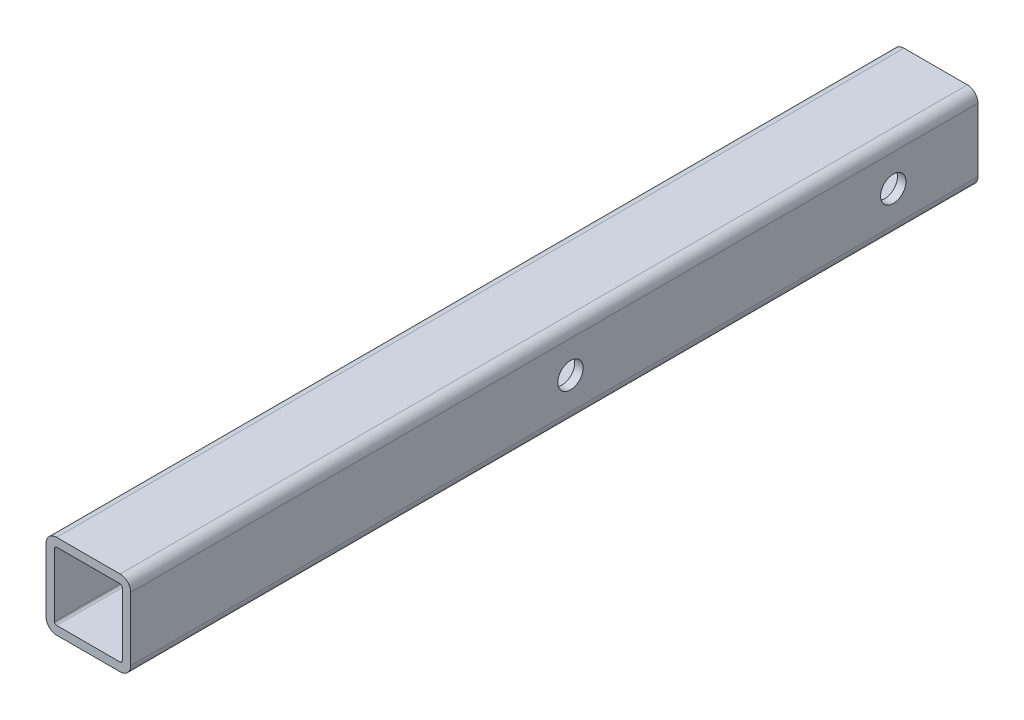
ISO-10303-21;
HEADER;
FILE_DESCRIPTION(('STEP AP214'),'2;1');
FILE_NAME('part.step','',(''),(''),'','','');
FILE_SCHEMA(('AUTOMOTIVE_DESIGN { 1 0 10303 214 1 1 1 1 }'));
ENDSEC;
DATA;
#1=APPLICATION_CONTEXT('core data for automotive mechanical design processes');
#2=APPLICATION_PROTOCOL_DEFINITION('international standard','automotive_design',2000,#1);
#3=PRODUCT_CONTEXT('',#1,'mechanical');
#4=PRODUCT('Part','Part','',(#3));
#5=PRODUCT_RELATED_PRODUCT_CATEGORY('part','',(#4));
#6=PRODUCT_DEFINITION_FORMATION('','',#4);
#7=PRODUCT_DEFINITION_CONTEXT('part definition',#1,'design');
#8=PRODUCT_DEFINITION('design','',#6,#7);
#9=PRODUCT_DEFINITION_SHAPE('','',#8);
#10=(LENGTH_UNIT() NAMED_UNIT(*) SI_UNIT(.MILLI.,.METRE.));
#11=(NAMED_UNIT(*) PLANE_ANGLE_UNIT() SI_UNIT($,.RADIAN.));
#12=(NAMED_UNIT(*) SI_UNIT($,.STERADIAN.) SOLID_ANGLE_UNIT());
#13=UNCERTAINTY_MEASURE_WITH_UNIT(LENGTH_MEASURE(1.E-05),#10,'distance_accuracy_value','');
#14=(GEOMETRIC_REPRESENTATION_CONTEXT(3) GLOBAL_UNCERTAINTY_ASSIGNED_CONTEXT((#13)) GLOBAL_UNIT_ASSIGNED_CONTEXT((#10,
#11,#12)) REPRESENTATION_CONTEXT('',''));
#15=CARTESIAN_POINT('',(0.,0.,0.));
#16=DIRECTION('',(0.,0.,1.));
#17=DIRECTION('',(1.,0.,0.));
#18=AXIS2_PLACEMENT_3D('',#15,#16,#17);
#19=CARTESIAN_POINT('',(-7.5,7.5,100.));
#20=DIRECTION('',(0.,0.,1.));
#21=DIRECTION('',(1.,0.,0.));
#22=AXIS2_PLACEMENT_3D('',#19,#20,#21);
#23=PLANE('',#22);
#24=CARTESIAN_POINT('',(-7.5,7.5,100.));
#25=DIRECTION('',(0.,0.,1.));
#26=DIRECTION('',(1.,0.,0.));
#27=AXIS2_PLACEMENT_3D('',#24,#25,#26);
#28=CIRCLE('',#27,2.5);
#29=CARTESIAN_POINT('',(-7.5,10.,100.));
#30=VERTEX_POINT('',#29);
#31=CARTESIAN_POINT('',(-10.,7.5,100.));
#32=VERTEX_POINT('',#31);
#33=EDGE_CURVE('E264',#30,#32,#28,.T.);
#34=ORIENTED_EDGE('',*,*,#33,.T.);
#35=DIRECTION('',(0.,-1.,0.));
#36=VECTOR('',#35,1.);
#37=CARTESIAN_POINT('',(-10.,-7.5,100.));
#38=LINE('',#37,#36);
#39=CARTESIAN_POINT('',(-10.,-7.5,100.));
#40=VERTEX_POINT('',#39);
#41=EDGE_CURVE('E267',#32,#40,#38,.T.);
#42=ORIENTED_EDGE('',*,*,#41,.T.);
#43=CARTESIAN_POINT('',(-7.5,-7.5,100.));
#44=DIRECTION('',(0.,0.,1.));
#45=DIRECTION('',(-1.,0.,0.));
#46=AXIS2_PLACEMENT_3D('',#43,#44,#45);
#47=CIRCLE('',#46,2.5);
#48=CARTESIAN_POINT('',(-7.5,-10.,100.));
#49=VERTEX_POINT('',#48);
#50=EDGE_CURVE('E270',#40,#49,#47,.T.);
#51=ORIENTED_EDGE('',*,*,#50,.T.);
#52=DIRECTION('',(1.,0.,0.));
#53=VECTOR('',#52,1.);
#54=CARTESIAN_POINT('',(7.5,-10.,100.));
#55=LINE('',#54,#53);
#56=CARTESIAN_POINT('',(7.5,-10.,100.));
#57=VERTEX_POINT('',#56);
#58=EDGE_CURVE('E272',#49,#57,#55,.T.);
#59=ORIENTED_EDGE('',*,*,#58,.T.);
#60=CARTESIAN_POINT('',(7.5,-7.5,100.));
#61=DIRECTION('',(0.,0.,1.));
#62=DIRECTION('',(1.,0.,0.));
#63=AXIS2_PLACEMENT_3D('',#60,#61,#62);
#64=CIRCLE('',#63,2.5);
#65=CARTESIAN_POINT('',(10.,-7.5,100.));
#66=VERTEX_POINT('',#65);
#67=EDGE_CURVE('E274',#57,#66,#64,.T.);
#68=ORIENTED_EDGE('',*,*,#67,.T.);
#69=DIRECTION('',(0.,1.,0.));
#70=VECTOR('',#69,1.);
#71=CARTESIAN_POINT('',(10.,-7.5,100.));
#72=LINE('',#71,#70);
#73=CARTESIAN_POINT('',(10.,7.5,100.));
#74=VERTEX_POINT('',#73);
#75=EDGE_CURVE('E276',#66,#74,#72,.T.);
#76=ORIENTED_EDGE('',*,*,#75,.T.);
#77=CARTESIAN_POINT('',(7.5,7.5,100.));
#78=DIRECTION('',(0.,0.,1.));
#79=DIRECTION('',(1.,0.,0.));
#80=AXIS2_PLACEMENT_3D('',#77,#78,#79);
#81=CIRCLE('',#80,2.5);
#82=CARTESIAN_POINT('',(7.5,10.,100.));
#83=VERTEX_POINT('',#82);
#84=EDGE_CURVE('E278',#74,#83,#81,.T.);
#85=ORIENTED_EDGE('',*,*,#84,.T.);
#86=DIRECTION('',(-1.,0.,0.));
#87=VECTOR('',#86,1.);
#88=CARTESIAN_POINT('',(7.5,10.,100.));
#89=LINE('',#88,#87);
#90=EDGE_CURVE('E280',#83,#30,#89,.T.);
#91=ORIENTED_EDGE('',*,*,#90,.T.);
#92=EDGE_LOOP('',(#34,#42,#51,#59,#68,#76,#85,#91));
#93=FACE_BOUND('',#92,.T.);
#94=DIRECTION('',(0.,-1.,0.));
#95=VECTOR('',#94,1.);
#96=CARTESIAN_POINT('',(-8.,-7.5,100.));
#97=LINE('',#96,#95);
#98=CARTESIAN_POINT('',(-8.,7.5,100.));
#99=VERTEX_POINT('',#98);
#100=CARTESIAN_POINT('',(-8.,-7.5,100.));
#101=VERTEX_POINT('',#100);
#102=EDGE_CURVE('E205',#99,#101,#97,.T.);
#103=ORIENTED_EDGE('',*,*,#102,.F.);
#104=CARTESIAN_POINT('',(-7.5,7.5,100.));
#105=DIRECTION('',(0.,0.,1.));
#106=DIRECTION('',(1.,0.,0.));
#107=AXIS2_PLACEMENT_3D('',#104,#105,#106);
#108=CIRCLE('',#107,0.499999999999999);
#109=CARTESIAN_POINT('',(-7.5,8.,100.));
#110=VERTEX_POINT('',#109);
#111=EDGE_CURVE('E197',#110,#99,#108,.T.);
#112=ORIENTED_EDGE('',*,*,#111,.F.);
#113=DIRECTION('',(-1.,0.,0.));
#114=VECTOR('',#113,1.);
#115=CARTESIAN_POINT('',(7.5,8.,100.));
#116=LINE('',#115,#114);
#117=CARTESIAN_POINT('',(7.5,8.,100.));
#118=VERTEX_POINT('',#117);
#119=EDGE_CURVE('E231',#118,#110,#116,.T.);
#120=ORIENTED_EDGE('',*,*,#119,.F.);
#121=CARTESIAN_POINT('',(7.5,7.5,100.));
#122=DIRECTION('',(0.,0.,1.));
#123=DIRECTION('',(1.,0.,0.));
#124=AXIS2_PLACEMENT_3D('',#121,#122,#123);
#125=CIRCLE('',#124,0.499999999999999);
#126=CARTESIAN_POINT('',(8.,7.5,100.));
#127=VERTEX_POINT('',#126);
#128=EDGE_CURVE('E229',#127,#118,#125,.T.);
#129=ORIENTED_EDGE('',*,*,#128,.F.);
#130=DIRECTION('',(0.,1.,0.));
#131=VECTOR('',#130,1.);
#132=CARTESIAN_POINT('',(8.,-7.5,100.));
#133=LINE('',#132,#131);
#134=CARTESIAN_POINT('',(8.,-7.5,100.));
#135=VERTEX_POINT('',#134);
#136=EDGE_CURVE('E227',#135,#127,#133,.T.);
#137=ORIENTED_EDGE('',*,*,#136,.F.);
#138=CARTESIAN_POINT('',(7.5,-7.5,100.));
#139=DIRECTION('',(0.,0.,1.));
#140=DIRECTION('',(1.,0.,0.));
#141=AXIS2_PLACEMENT_3D('',#138,#139,#140);
#142=CIRCLE('',#141,0.500000000000001);
#143=CARTESIAN_POINT('',(7.5,-8.,100.));
#144=VERTEX_POINT('',#143);
#145=EDGE_CURVE('E225',#144,#135,#142,.T.);
#146=ORIENTED_EDGE('',*,*,#145,.F.);
#147=DIRECTION('',(1.,0.,0.));
#148=VECTOR('',#147,1.);
#149=CARTESIAN_POINT('',(7.5,-8.,100.));
#150=LINE('',#149,#148);
#151=CARTESIAN_POINT('',(-7.5,-8.,100.));
#152=VERTEX_POINT('',#151);
#153=EDGE_CURVE('E220',#152,#144,#150,.T.);
#154=ORIENTED_EDGE('',*,*,#153,.F.);
#155=CARTESIAN_POINT('',(-7.5,-7.5,100.));
#156=DIRECTION('',(0.,0.,1.));
#157=DIRECTION('',(1.,0.,0.));
#158=AXIS2_PLACEMENT_3D('',#155,#156,#157);
#159=CIRCLE('',#158,0.500000000000002);
#160=EDGE_CURVE('E218',#101,#152,#159,.T.);
#161=ORIENTED_EDGE('',*,*,#160,.F.);
#162=EDGE_LOOP('',(#103,#112,#120,#129,#137,#146,#154,#161));
#163=FACE_BOUND('',#162,.T.);
#164=ADVANCED_FACE('F82',(#93,#163),#23,.T.);
#165=CARTESIAN_POINT('',(-7.5,7.5,-100.));
#166=DIRECTION('',(0.,0.,1.));
#167=DIRECTION('',(1.,0.,0.));
#168=AXIS2_PLACEMENT_3D('',#165,#166,#167);
#169=PLANE('',#168);
#170=CARTESIAN_POINT('',(-7.5,7.5,-100.));
#171=DIRECTION('',(0.,0.,1.));
#172=DIRECTION('',(1.,0.,0.));
#173=AXIS2_PLACEMENT_3D('',#170,#171,#172);
#174=CIRCLE('',#173,2.5);
#175=CARTESIAN_POINT('',(-7.5,10.,-100.));
#176=VERTEX_POINT('',#175);
#177=CARTESIAN_POINT('',(-10.,7.5,-100.));
#178=VERTEX_POINT('',#177);
#179=EDGE_CURVE('E213',#176,#178,#174,.T.);
#180=ORIENTED_EDGE('',*,*,#179,.F.);
#181=DIRECTION('',(-1.,0.,0.));
#182=VECTOR('',#181,1.);
#183=CARTESIAN_POINT('',(7.5,10.,-100.));
#184=LINE('',#183,#182);
#185=CARTESIAN_POINT('',(7.5,10.,-100.));
#186=VERTEX_POINT('',#185);
#187=EDGE_CURVE('E268',#186,#176,#184,.T.);
#188=ORIENTED_EDGE('',*,*,#187,.F.);
#189=CARTESIAN_POINT('',(7.5,7.5,-100.));
#190=DIRECTION('',(0.,0.,1.));
#191=DIRECTION('',(1.,0.,0.));
#192=AXIS2_PLACEMENT_3D('',#189,#190,#191);
#193=CIRCLE('',#192,2.5);
#194=CARTESIAN_POINT('',(10.,7.5,-100.));
#195=VERTEX_POINT('',#194);
#196=EDGE_CURVE('E295',#195,#186,#193,.T.);
#197=ORIENTED_EDGE('',*,*,#196,.F.);
#198=DIRECTION('',(0.,1.,0.));
#199=VECTOR('',#198,1.);
#200=CARTESIAN_POINT('',(10.,-7.5,-100.));
#201=LINE('',#200,#199);
#202=CARTESIAN_POINT('',(10.,-7.5,-100.));
#203=VERTEX_POINT('',#202);
#204=EDGE_CURVE('E293',#203,#195,#201,.T.);
#205=ORIENTED_EDGE('',*,*,#204,.F.);
#206=CARTESIAN_POINT('',(7.5,-7.5,-100.));
#207=DIRECTION('',(0.,0.,1.));
#208=DIRECTION('',(1.,0.,0.));
#209=AXIS2_PLACEMENT_3D('',#206,#207,#208);
#210=CIRCLE('',#209,2.5);
#211=CARTESIAN_POINT('',(7.5,-10.,-100.));
#212=VERTEX_POINT('',#211);
#213=EDGE_CURVE('E291',#212,#203,#210,.T.);
#214=ORIENTED_EDGE('',*,*,#213,.F.);
#215=DIRECTION('',(1.,0.,0.));
#216=VECTOR('',#215,1.);
#217=CARTESIAN_POINT('',(7.5,-10.,-100.));
#218=LINE('',#217,#216);
#219=CARTESIAN_POINT('',(-7.5,-10.,-100.));
#220=VERTEX_POINT('',#219);
#221=EDGE_CURVE('E289',#220,#212,#218,.T.);
#222=ORIENTED_EDGE('',*,*,#221,.F.);
#223=CARTESIAN_POINT('',(-7.5,-7.5,-100.));
#224=DIRECTION('',(0.,0.,1.));
#225=DIRECTION('',(-1.,0.,0.));
#226=AXIS2_PLACEMENT_3D('',#223,#224,#225);
#227=CIRCLE('',#226,2.5);
#228=CARTESIAN_POINT('',(-10.,-7.5,-100.));
#229=VERTEX_POINT('',#228);
#230=EDGE_CURVE('E287',#229,#220,#227,.T.);
#231=ORIENTED_EDGE('',*,*,#230,.F.);
#232=DIRECTION('',(0.,-1.,0.));
#233=VECTOR('',#232,1.);
#234=CARTESIAN_POINT('',(-10.,-7.5,-100.));
#235=LINE('',#234,#233);
#236=EDGE_CURVE('E285',#178,#229,#235,.T.);
#237=ORIENTED_EDGE('',*,*,#236,.F.);
#238=EDGE_LOOP('',(#180,#188,#197,#205,#214,#222,#231,#237));
#239=FACE_BOUND('',#238,.T.);
#240=CARTESIAN_POINT('',(-7.5,7.5,-100.));
#241=DIRECTION('',(0.,0.,1.));
#242=DIRECTION('',(1.,0.,0.));
#243=AXIS2_PLACEMENT_3D('',#240,#241,#242);
#244=CIRCLE('',#243,0.499999999999999);
#245=CARTESIAN_POINT('',(-7.5,8.,-100.));
#246=VERTEX_POINT('',#245);
#247=CARTESIAN_POINT('',(-8.,7.5,-100.));
#248=VERTEX_POINT('',#247);
#249=EDGE_CURVE('E107',#246,#248,#244,.T.);
#250=ORIENTED_EDGE('',*,*,#249,.T.);
#251=DIRECTION('',(0.,-1.,0.));
#252=VECTOR('',#251,1.);
#253=CARTESIAN_POINT('',(-8.,-7.5,-100.));
#254=LINE('',#253,#252);
#255=CARTESIAN_POINT('',(-8.,-7.5,-100.));
#256=VERTEX_POINT('',#255);
#257=EDGE_CURVE('E212',#248,#256,#254,.T.);
#258=ORIENTED_EDGE('',*,*,#257,.T.);
#259=CARTESIAN_POINT('',(-7.5,-7.5,-100.));
#260=DIRECTION('',(0.,0.,1.));
#261=DIRECTION('',(1.,0.,0.));
#262=AXIS2_PLACEMENT_3D('',#259,#260,#261);
#263=CIRCLE('',#262,0.500000000000002);
#264=CARTESIAN_POINT('',(-7.5,-8.,-100.));
#265=VERTEX_POINT('',#264);
#266=EDGE_CURVE('E236',#256,#265,#263,.T.);
#267=ORIENTED_EDGE('',*,*,#266,.T.);
#268=DIRECTION('',(1.,0.,0.));
#269=VECTOR('',#268,1.);
#270=CARTESIAN_POINT('',(7.5,-8.,-100.));
#271=LINE('',#270,#269);
#272=CARTESIAN_POINT('',(7.5,-8.,-100.));
#273=VERTEX_POINT('',#272);
#274=EDGE_CURVE('E239',#265,#273,#271,.T.);
#275=ORIENTED_EDGE('',*,*,#274,.T.);
#276=CARTESIAN_POINT('',(7.5,-7.5,-100.));
#277=DIRECTION('',(0.,0.,1.));
#278=DIRECTION('',(1.,0.,0.));
#279=AXIS2_PLACEMENT_3D('',#276,#277,#278);
#280=CIRCLE('',#279,0.500000000000001);
#281=CARTESIAN_POINT('',(8.,-7.5,-100.));
#282=VERTEX_POINT('',#281);
#283=EDGE_CURVE('E242',#273,#282,#280,.T.);
#284=ORIENTED_EDGE('',*,*,#283,.T.);
#285=DIRECTION('',(0.,1.,0.));
#286=VECTOR('',#285,1.);
#287=CARTESIAN_POINT('',(8.,-7.5,-100.));
#288=LINE('',#287,#286);
#289=CARTESIAN_POINT('',(8.,7.5,-100.));
#290=VERTEX_POINT('',#289);
#291=EDGE_CURVE('E245',#282,#290,#288,.T.);
#292=ORIENTED_EDGE('',*,*,#291,.T.);
#293=CARTESIAN_POINT('',(7.5,7.5,-100.));
#294=DIRECTION('',(0.,0.,1.));
#295=DIRECTION('',(1.,0.,0.));
#296=AXIS2_PLACEMENT_3D('',#293,#294,#295);
#297=CIRCLE('',#296,0.499999999999999);
#298=CARTESIAN_POINT('',(7.5,8.,-100.));
#299=VERTEX_POINT('',#298);
#300=EDGE_CURVE('E248',#290,#299,#297,.T.);
#301=ORIENTED_EDGE('',*,*,#300,.T.);
#302=DIRECTION('',(-1.,0.,0.));
#303=VECTOR('',#302,1.);
#304=CARTESIAN_POINT('',(7.5,8.,-100.));
#305=LINE('',#304,#303);
#306=EDGE_CURVE('E206',#299,#246,#305,.T.);
#307=ORIENTED_EDGE('',*,*,#306,.T.);
#308=EDGE_LOOP('',(#250,#258,#267,#275,#284,#292,#301,#307));
#309=FACE_BOUND('',#308,.T.);
#310=ADVANCED_FACE('F355',(#239,#309),#169,.F.);
#311=CARTESIAN_POINT('',(-7.5,7.5,100.));
#312=DIRECTION('',(0.,0.,-1.));
#313=DIRECTION('',(-1.,0.,0.));
#314=AXIS2_PLACEMENT_3D('',#311,#312,#313);
#315=CYLINDRICAL_SURFACE('',#314,2.5);
#316=ORIENTED_EDGE('',*,*,#179,.T.);
#317=DIRECTION('',(0.,0.,-1.));
#318=VECTOR('',#317,1.);
#319=CARTESIAN_POINT('',(-10.,7.5,100.));
#320=LINE('',#319,#318);
#321=EDGE_CURVE('E12',#32,#178,#320,.T.);
#322=ORIENTED_EDGE('',*,*,#321,.F.);
#323=ORIENTED_EDGE('',*,*,#33,.F.);
#324=DIRECTION('',(0.,0.,-1.));
#325=VECTOR('',#324,1.);
#326=CARTESIAN_POINT('',(-7.5,10.,100.));
#327=LINE('',#326,#325);
#328=EDGE_CURVE('E282',#30,#176,#327,.T.);
#329=ORIENTED_EDGE('',*,*,#328,.T.);
#330=EDGE_LOOP('',(#316,#322,#323,#329));
#331=FACE_BOUND('',#330,.T.);
#332=ADVANCED_FACE('F84',(#331),#315,.T.);
#333=CARTESIAN_POINT('',(-10.,-7.5,100.));
#334=DIRECTION('',(1.,0.,0.));
#335=DIRECTION('',(0.,1.,0.));
#336=AXIS2_PLACEMENT_3D('',#333,#334,#335);
#337=PLANE('',#336);
#338=CARTESIAN_POINT('',(-10.,0.,-3.8));
#339=DIRECTION('',(1.,0.,0.));
#340=DIRECTION('',(0.,1.,0.));
#341=AXIS2_PLACEMENT_3D('',#338,#339,#340);
#342=CIRCLE('',#341,3.);
#343=CARTESIAN_POINT('',(-10.,3.,-3.8));
#344=VERTEX_POINT('',#343);
#345=EDGE_CURVE('E325',#344,#344,#342,.T.);
#346=ORIENTED_EDGE('',*,*,#345,.T.);
#347=EDGE_LOOP('',(#346));
#348=FACE_BOUND('',#347,.T.);
#349=CARTESIAN_POINT('',(-10.,0.,-80.));
#350=DIRECTION('',(1.,0.,0.));
#351=DIRECTION('',(0.,1.,0.));
#352=AXIS2_PLACEMENT_3D('',#349,#350,#351);
#353=CIRCLE('',#352,3.00000000000001);
#354=CARTESIAN_POINT('',(-10.,3.00000000000001,-80.));
#355=VERTEX_POINT('',#354);
#356=EDGE_CURVE('E234',#355,#355,#353,.T.);
#357=ORIENTED_EDGE('',*,*,#356,.T.);
#358=EDGE_LOOP('',(#357));
#359=FACE_BOUND('',#358,.T.);
#360=ORIENTED_EDGE('',*,*,#236,.T.);
#361=DIRECTION('',(0.,0.,-1.));
#362=VECTOR('',#361,1.);
#363=CARTESIAN_POINT('',(-10.,-7.5,100.));
#364=LINE('',#363,#362);
#365=EDGE_CURVE('E91',#40,#229,#364,.T.);
#366=ORIENTED_EDGE('',*,*,#365,.F.);
#367=ORIENTED_EDGE('',*,*,#41,.F.);
#368=ORIENTED_EDGE('',*,*,#321,.T.);
#369=EDGE_LOOP('',(#360,#366,#367,#368));
#370=FACE_BOUND('',#369,.T.);
#371=ADVANCED_FACE('F336',(#348,#359,#370),#337,.F.);
#372=CARTESIAN_POINT('',(-7.5,-7.5,100.));
#373=DIRECTION('',(0.,0.,-1.));
#374=DIRECTION('',(-1.,0.,0.));
#375=AXIS2_PLACEMENT_3D('',#372,#373,#374);
#376=CYLINDRICAL_SURFACE('',#375,2.5);
#377=ORIENTED_EDGE('',*,*,#230,.T.);
#378=DIRECTION('',(0.,0.,-1.));
#379=VECTOR('',#378,1.);
#380=CARTESIAN_POINT('',(-7.5,-10.,100.));
#381=LINE('',#380,#379);
#382=EDGE_CURVE('E312',#49,#220,#381,.T.);
#383=ORIENTED_EDGE('',*,*,#382,.F.);
#384=ORIENTED_EDGE('',*,*,#50,.F.);
#385=ORIENTED_EDGE('',*,*,#365,.T.);
#386=EDGE_LOOP('',(#377,#383,#384,#385));
#387=FACE_BOUND('',#386,.T.);
#388=ADVANCED_FACE('F385',(#387),#376,.T.);
#389=CARTESIAN_POINT('',(7.5,-10.,100.));
#390=DIRECTION('',(0.,1.,0.));
#391=DIRECTION('',(-1.,0.,0.));
#392=AXIS2_PLACEMENT_3D('',#389,#390,#391);
#393=PLANE('',#392);
#394=ORIENTED_EDGE('',*,*,#221,.T.);
#395=DIRECTION('',(0.,0.,-1.));
#396=VECTOR('',#395,1.);
#397=CARTESIAN_POINT('',(7.5,-10.,100.));
#398=LINE('',#397,#396);
#399=EDGE_CURVE('E309',#57,#212,#398,.T.);
#400=ORIENTED_EDGE('',*,*,#399,.F.);
#401=ORIENTED_EDGE('',*,*,#58,.F.);
#402=ORIENTED_EDGE('',*,*,#382,.T.);
#403=EDGE_LOOP('',(#394,#400,#401,#402));
#404=FACE_BOUND('',#403,.T.);
#405=ADVANCED_FACE('F381',(#404),#393,.F.);
#406=CARTESIAN_POINT('',(7.5,-7.5,100.));
#407=DIRECTION('',(0.,0.,-1.));
#408=DIRECTION('',(-1.,0.,0.));
#409=AXIS2_PLACEMENT_3D('',#406,#407,#408);
#410=CYLINDRICAL_SURFACE('',#409,2.5);
#411=ORIENTED_EDGE('',*,*,#213,.T.);
#412=DIRECTION('',(0.,0.,-1.));
#413=VECTOR('',#412,1.);
#414=CARTESIAN_POINT('',(10.,-7.5,100.));
#415=LINE('',#414,#413);
#416=EDGE_CURVE('E306',#66,#203,#415,.T.);
#417=ORIENTED_EDGE('',*,*,#416,.F.);
#418=ORIENTED_EDGE('',*,*,#67,.F.);
#419=ORIENTED_EDGE('',*,*,#399,.T.);
#420=EDGE_LOOP('',(#411,#417,#418,#419));
#421=FACE_BOUND('',#420,.T.);
#422=ADVANCED_FACE('F377',(#421),#410,.T.);
#423=CARTESIAN_POINT('',(10.,-7.5,100.));
#424=DIRECTION('',(-1.,0.,0.));
#425=DIRECTION('',(0.,-1.,0.));
#426=AXIS2_PLACEMENT_3D('',#423,#424,#425);
#427=PLANE('',#426);
#428=CARTESIAN_POINT('',(10.,0.,-3.8));
#429=DIRECTION('',(1.,0.,0.));
#430=DIRECTION('',(0.,1.,0.));
#431=AXIS2_PLACEMENT_3D('',#428,#429,#430);
#432=CIRCLE('',#431,3.);
#433=CARTESIAN_POINT('',(10.,3.,-3.8));
#434=VERTEX_POINT('',#433);
#435=EDGE_CURVE('E406',#434,#434,#432,.T.);
#436=ORIENTED_EDGE('',*,*,#435,.F.);
#437=EDGE_LOOP('',(#436));
#438=FACE_BOUND('',#437,.T.);
#439=CARTESIAN_POINT('',(10.,0.,-80.));
#440=DIRECTION('',(1.,0.,0.));
#441=DIRECTION('',(0.,1.,0.));
#442=AXIS2_PLACEMENT_3D('',#439,#440,#441);
#443=CIRCLE('',#442,3.00000000000001);
#444=CARTESIAN_POINT('',(10.,3.00000000000001,-80.));
#445=VERTEX_POINT('',#444);
#446=EDGE_CURVE('E319',#445,#445,#443,.T.);
#447=ORIENTED_EDGE('',*,*,#446,.F.);
#448=EDGE_LOOP('',(#447));
#449=FACE_BOUND('',#448,.T.);
#450=ORIENTED_EDGE('',*,*,#204,.T.);
#451=DIRECTION('',(0.,0.,-1.));
#452=VECTOR('',#451,1.);
#453=CARTESIAN_POINT('',(10.,7.5,100.));
#454=LINE('',#453,#452);
#455=EDGE_CURVE('E303',#74,#195,#454,.T.);
#456=ORIENTED_EDGE('',*,*,#455,.F.);
#457=ORIENTED_EDGE('',*,*,#75,.F.);
#458=ORIENTED_EDGE('',*,*,#416,.T.);
#459=EDGE_LOOP('',(#450,#456,#457,#458));
#460=FACE_BOUND('',#459,.T.);
#461=ADVANCED_FACE('F373',(#438,#449,#460),#427,.F.);
#462=CARTESIAN_POINT('',(7.5,7.5,100.));
#463=DIRECTION('',(0.,0.,-1.));
#464=DIRECTION('',(-1.,0.,0.));
#465=AXIS2_PLACEMENT_3D('',#462,#463,#464);
#466=CYLINDRICAL_SURFACE('',#465,2.5);
#467=ORIENTED_EDGE('',*,*,#196,.T.);
#468=DIRECTION('',(0.,0.,-1.));
#469=VECTOR('',#468,1.);
#470=CARTESIAN_POINT('',(7.5,10.,100.));
#471=LINE('',#470,#469);
#472=EDGE_CURVE('E300',#83,#186,#471,.T.);
#473=ORIENTED_EDGE('',*,*,#472,.F.);
#474=ORIENTED_EDGE('',*,*,#84,.F.);
#475=ORIENTED_EDGE('',*,*,#455,.T.);
#476=EDGE_LOOP('',(#467,#473,#474,#475));
#477=FACE_BOUND('',#476,.T.);
#478=ADVANCED_FACE('F369',(#477),#466,.T.);
#479=CARTESIAN_POINT('',(7.5,10.,100.));
#480=DIRECTION('',(0.,-1.,0.));
#481=DIRECTION('',(1.,0.,0.));
#482=AXIS2_PLACEMENT_3D('',#479,#480,#481);
#483=PLANE('',#482);
#484=ORIENTED_EDGE('',*,*,#187,.T.);
#485=ORIENTED_EDGE('',*,*,#328,.F.);
#486=ORIENTED_EDGE('',*,*,#90,.F.);
#487=ORIENTED_EDGE('',*,*,#472,.T.);
#488=EDGE_LOOP('',(#484,#485,#486,#487));
#489=FACE_BOUND('',#488,.T.);
#490=ADVANCED_FACE('F366',(#489),#483,.F.);
#491=CARTESIAN_POINT('',(-7.5,7.5,100.));
#492=DIRECTION('',(0.,0.,-1.));
#493=DIRECTION('',(-1.,0.,0.));
#494=AXIS2_PLACEMENT_3D('',#491,#492,#493);
#495=CYLINDRICAL_SURFACE('',#494,0.499999999999999);
#496=ORIENTED_EDGE('',*,*,#249,.F.);
#497=DIRECTION('',(0.,0.,-1.));
#498=VECTOR('',#497,1.);
#499=CARTESIAN_POINT('',(-7.5,8.,100.));
#500=LINE('',#499,#498);
#501=EDGE_CURVE('E201',#110,#246,#500,.T.);
#502=ORIENTED_EDGE('',*,*,#501,.F.);
#503=ORIENTED_EDGE('',*,*,#111,.T.);
#504=DIRECTION('',(0.,0.,-1.));
#505=VECTOR('',#504,1.);
#506=CARTESIAN_POINT('',(-8.,7.5,100.));
#507=LINE('',#506,#505);
#508=EDGE_CURVE('E200',#99,#248,#507,.T.);
#509=ORIENTED_EDGE('',*,*,#508,.T.);
#510=EDGE_LOOP('',(#496,#502,#503,#509));
#511=FACE_BOUND('',#510,.T.);
#512=ADVANCED_FACE('F199',(#511),#495,.F.);
#513=CARTESIAN_POINT('',(-8.,-7.5,100.));
#514=DIRECTION('',(1.,0.,0.));
#515=DIRECTION('',(0.,1.,0.));
#516=AXIS2_PLACEMENT_3D('',#513,#514,#515);
#517=PLANE('',#516);
#518=CARTESIAN_POINT('',(-8.,0.,-3.8));
#519=DIRECTION('',(1.,0.,0.));
#520=DIRECTION('',(0.,1.,0.));
#521=AXIS2_PLACEMENT_3D('',#518,#519,#520);
#522=CIRCLE('',#521,3.);
#523=CARTESIAN_POINT('',(-8.,3.,-3.8));
#524=VERTEX_POINT('',#523);
#525=EDGE_CURVE('E330',#524,#524,#522,.T.);
#526=ORIENTED_EDGE('',*,*,#525,.F.);
#527=EDGE_LOOP('',(#526));
#528=FACE_BOUND('',#527,.T.);
#529=CARTESIAN_POINT('',(-8.,0.,-80.));
#530=DIRECTION('',(1.,0.,0.));
#531=DIRECTION('',(0.,1.,0.));
#532=AXIS2_PLACEMENT_3D('',#529,#530,#531);
#533=CIRCLE('',#532,3.00000000000001);
#534=CARTESIAN_POINT('',(-8.,3.00000000000001,-80.));
#535=VERTEX_POINT('',#534);
#536=EDGE_CURVE('E318',#535,#535,#533,.T.);
#537=ORIENTED_EDGE('',*,*,#536,.F.);
#538=EDGE_LOOP('',(#537));
#539=FACE_BOUND('',#538,.T.);
#540=ORIENTED_EDGE('',*,*,#257,.F.);
#541=ORIENTED_EDGE('',*,*,#508,.F.);
#542=ORIENTED_EDGE('',*,*,#102,.T.);
#543=DIRECTION('',(0.,0.,-1.));
#544=VECTOR('',#543,1.);
#545=CARTESIAN_POINT('',(-8.,-7.5,100.));
#546=LINE('',#545,#544);
#547=EDGE_CURVE('E214',#101,#256,#546,.T.);
#548=ORIENTED_EDGE('',*,*,#547,.T.);
#549=EDGE_LOOP('',(#540,#541,#542,#548));
#550=FACE_BOUND('',#549,.T.);
#551=ADVANCED_FACE('F209',(#528,#539,#550),#517,.T.);
#552=CARTESIAN_POINT('',(-7.5,-7.5,100.));
#553=DIRECTION('',(0.,0.,-1.));
#554=DIRECTION('',(-1.,0.,0.));
#555=AXIS2_PLACEMENT_3D('',#552,#553,#554);
#556=CYLINDRICAL_SURFACE('',#555,0.500000000000002);
#557=ORIENTED_EDGE('',*,*,#266,.F.);
#558=ORIENTED_EDGE('',*,*,#547,.F.);
#559=ORIENTED_EDGE('',*,*,#160,.T.);
#560=DIRECTION('',(0.,0.,-1.));
#561=VECTOR('',#560,1.);
#562=CARTESIAN_POINT('',(-7.5,-8.,100.));
#563=LINE('',#562,#561);
#564=EDGE_CURVE('E261',#152,#265,#563,.T.);
#565=ORIENTED_EDGE('',*,*,#564,.T.);
#566=EDGE_LOOP('',(#557,#558,#559,#565));
#567=FACE_BOUND('',#566,.T.);
#568=ADVANCED_FACE('F457',(#567),#556,.F.);
#569=CARTESIAN_POINT('',(7.5,-8.,100.));
#570=DIRECTION('',(0.,1.,0.));
#571=DIRECTION('',(-1.,0.,0.));
#572=AXIS2_PLACEMENT_3D('',#569,#570,#571);
#573=PLANE('',#572);
#574=ORIENTED_EDGE('',*,*,#274,.F.);
#575=ORIENTED_EDGE('',*,*,#564,.F.);
#576=ORIENTED_EDGE('',*,*,#153,.T.);
#577=DIRECTION('',(0.,0.,-1.));
#578=VECTOR('',#577,1.);
#579=CARTESIAN_POINT('',(7.5,-8.,100.));
#580=LINE('',#579,#578);
#581=EDGE_CURVE('E259',#144,#273,#580,.T.);
#582=ORIENTED_EDGE('',*,*,#581,.T.);
#583=EDGE_LOOP('',(#574,#575,#576,#582));
#584=FACE_BOUND('',#583,.T.);
#585=ADVANCED_FACE('F454',(#584),#573,.T.);
#586=CARTESIAN_POINT('',(7.5,-7.5,100.));
#587=DIRECTION('',(0.,0.,-1.));
#588=DIRECTION('',(-1.,0.,0.));
#589=AXIS2_PLACEMENT_3D('',#586,#587,#588);
#590=CYLINDRICAL_SURFACE('',#589,0.500000000000001);
#591=ORIENTED_EDGE('',*,*,#283,.F.);
#592=ORIENTED_EDGE('',*,*,#581,.F.);
#593=ORIENTED_EDGE('',*,*,#145,.T.);
#594=DIRECTION('',(0.,0.,-1.));
#595=VECTOR('',#594,1.);
#596=CARTESIAN_POINT('',(8.,-7.5,100.));
#597=LINE('',#596,#595);
#598=EDGE_CURVE('E257',#135,#282,#597,.T.);
#599=ORIENTED_EDGE('',*,*,#598,.T.);
#600=EDGE_LOOP('',(#591,#592,#593,#599));
#601=FACE_BOUND('',#600,.T.);
#602=ADVANCED_FACE('F449',(#601),#590,.F.);
#603=CARTESIAN_POINT('',(8.,-7.5,100.));
#604=DIRECTION('',(-1.,0.,0.));
#605=DIRECTION('',(0.,-1.,0.));
#606=AXIS2_PLACEMENT_3D('',#603,#604,#605);
#607=PLANE('',#606);
#608=CARTESIAN_POINT('',(8.,0.,-3.8));
#609=DIRECTION('',(-1.,0.,0.));
#610=DIRECTION('',(0.,-1.,0.));
#611=AXIS2_PLACEMENT_3D('',#608,#609,#610);
#612=CIRCLE('',#611,3.);
#613=CARTESIAN_POINT('',(8.,-3.,-3.8));
#614=VERTEX_POINT('',#613);
#615=EDGE_CURVE('E86',#614,#614,#612,.T.);
#616=ORIENTED_EDGE('',*,*,#615,.F.);
#617=EDGE_LOOP('',(#616));
#618=FACE_BOUND('',#617,.T.);
#619=CARTESIAN_POINT('',(8.,0.,-80.));
#620=DIRECTION('',(-1.,0.,0.));
#621=DIRECTION('',(0.,-1.,0.));
#622=AXIS2_PLACEMENT_3D('',#619,#620,#621);
#623=CIRCLE('',#622,3.00000000000001);
#624=CARTESIAN_POINT('',(8.,-3.00000000000001,-80.));
#625=VERTEX_POINT('',#624);
#626=EDGE_CURVE('E316',#625,#625,#623,.T.);
#627=ORIENTED_EDGE('',*,*,#626,.F.);
#628=EDGE_LOOP('',(#627));
#629=FACE_BOUND('',#628,.T.);
#630=ORIENTED_EDGE('',*,*,#291,.F.);
#631=ORIENTED_EDGE('',*,*,#598,.F.);
#632=ORIENTED_EDGE('',*,*,#136,.T.);
#633=DIRECTION('',(0.,0.,-1.));
#634=VECTOR('',#633,1.);
#635=CARTESIAN_POINT('',(8.,7.5,100.));
#636=LINE('',#635,#634);
#637=EDGE_CURVE('E255',#127,#290,#636,.T.);
#638=ORIENTED_EDGE('',*,*,#637,.T.);
#639=EDGE_LOOP('',(#630,#631,#632,#638));
#640=FACE_BOUND('',#639,.T.);
#641=ADVANCED_FACE('F445',(#618,#629,#640),#607,.T.);
#642=CARTESIAN_POINT('',(7.5,7.5,100.));
#643=DIRECTION('',(0.,0.,-1.));
#644=DIRECTION('',(-1.,0.,0.));
#645=AXIS2_PLACEMENT_3D('',#642,#643,#644);
#646=CYLINDRICAL_SURFACE('',#645,0.499999999999999);
#647=ORIENTED_EDGE('',*,*,#300,.F.);
#648=ORIENTED_EDGE('',*,*,#637,.F.);
#649=ORIENTED_EDGE('',*,*,#128,.T.);
#650=DIRECTION('',(0.,0.,-1.));
#651=VECTOR('',#650,1.);
#652=CARTESIAN_POINT('',(7.5,8.,100.));
#653=LINE('',#652,#651);
#654=EDGE_CURVE('E99',#118,#299,#653,.T.);
#655=ORIENTED_EDGE('',*,*,#654,.T.);
#656=EDGE_LOOP('',(#647,#648,#649,#655));
#657=FACE_BOUND('',#656,.T.);
#658=ADVANCED_FACE('F442',(#657),#646,.F.);
#659=CARTESIAN_POINT('',(7.5,8.,100.));
#660=DIRECTION('',(0.,-1.,0.));
#661=DIRECTION('',(1.,0.,0.));
#662=AXIS2_PLACEMENT_3D('',#659,#660,#661);
#663=PLANE('',#662);
#664=ORIENTED_EDGE('',*,*,#306,.F.);
#665=ORIENTED_EDGE('',*,*,#654,.F.);
#666=ORIENTED_EDGE('',*,*,#119,.T.);
#667=ORIENTED_EDGE('',*,*,#501,.T.);
#668=EDGE_LOOP('',(#664,#665,#666,#667));
#669=FACE_BOUND('',#668,.T.);
#670=ADVANCED_FACE('F352',(#669),#663,.T.);
#671=CARTESIAN_POINT('',(-10.32,0.,-80.));
#672=DIRECTION('',(1.,0.,0.));
#673=DIRECTION('',(0.,1.,0.));
#674=AXIS2_PLACEMENT_3D('',#671,#672,#673);
#675=CYLINDRICAL_SURFACE('',#674,3.00000000000001);
#676=ORIENTED_EDGE('',*,*,#626,.T.);
#677=EDGE_LOOP('',(#676));
#678=FACE_BOUND('',#677,.T.);
#679=ORIENTED_EDGE('',*,*,#446,.T.);
#680=EDGE_LOOP('',(#679));
#681=FACE_BOUND('',#680,.T.);
#682=ADVANCED_FACE('F342',(#678,#681),#675,.F.);
#683=ORIENTED_EDGE('',*,*,#536,.T.);
#684=EDGE_LOOP('',(#683));
#685=FACE_BOUND('',#684,.T.);
#686=ORIENTED_EDGE('',*,*,#356,.F.);
#687=EDGE_LOOP('',(#686));
#688=FACE_BOUND('',#687,.T.);
#689=ADVANCED_FACE('F339',(#685,#688),#675,.F.);
#690=CARTESIAN_POINT('',(-10.32,0.,-3.8));
#691=DIRECTION('',(1.,0.,0.));
#692=DIRECTION('',(0.,1.,0.));
#693=AXIS2_PLACEMENT_3D('',#690,#691,#692);
#694=CYLINDRICAL_SURFACE('',#693,3.);
#695=ORIENTED_EDGE('',*,*,#615,.T.);
#696=EDGE_LOOP('',(#695));
#697=FACE_BOUND('',#696,.T.);
#698=ORIENTED_EDGE('',*,*,#435,.T.);
#699=EDGE_LOOP('',(#698));
#700=FACE_BOUND('',#699,.T.);
#701=ADVANCED_FACE('F341',(#697,#700),#694,.F.);
#702=ORIENTED_EDGE('',*,*,#525,.T.);
#703=EDGE_LOOP('',(#702));
#704=FACE_BOUND('',#703,.T.);
#705=ORIENTED_EDGE('',*,*,#345,.F.);
#706=EDGE_LOOP('',(#705));
#707=FACE_BOUND('',#706,.T.);
#708=ADVANCED_FACE('F349',(#704,#707),#694,.F.);
#709=CLOSED_SHELL('',(#164,#310,#332,#371,#388,#405,#422,#461,#478,#490,#512,#551,#568,#585,
#602,#641,#658,#670,#682,#689,#701,#708));
#710=MANIFOLD_SOLID_BREP('B2',#709);
#711=ADVANCED_BREP_SHAPE_REPRESENTATION('',(#18,#710),#14);
#712=SHAPE_DEFINITION_REPRESENTATION(#9,#711);
ENDSEC;
END-ISO-10303-21;
